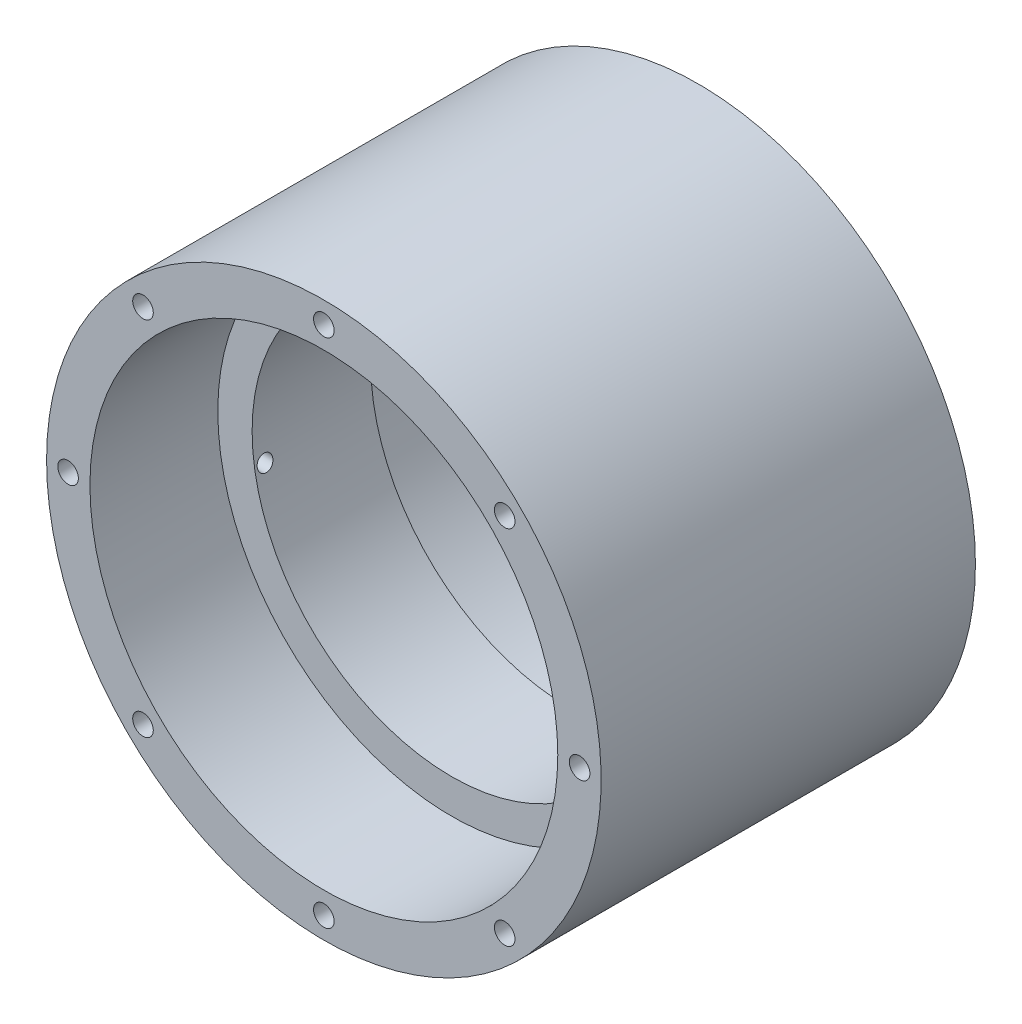
ISO-10303-21;
HEADER;
FILE_DESCRIPTION(('STEP AP214'),'2;1');
FILE_NAME('part.step','',(''),(''),'','','');
FILE_SCHEMA(('AUTOMOTIVE_DESIGN { 1 0 10303 214 1 1 1 1 }'));
ENDSEC;
DATA;
#1=APPLICATION_CONTEXT('core data for automotive mechanical design processes');
#2=APPLICATION_PROTOCOL_DEFINITION('international standard','automotive_design',2000,#1);
#3=PRODUCT_CONTEXT('',#1,'mechanical');
#4=PRODUCT('Part','Part','',(#3));
#5=PRODUCT_RELATED_PRODUCT_CATEGORY('part','',(#4));
#6=PRODUCT_DEFINITION_FORMATION('','',#4);
#7=PRODUCT_DEFINITION_CONTEXT('part definition',#1,'design');
#8=PRODUCT_DEFINITION('design','',#6,#7);
#9=PRODUCT_DEFINITION_SHAPE('','',#8);
#10=(LENGTH_UNIT() NAMED_UNIT(*) SI_UNIT(.MILLI.,.METRE.));
#11=(NAMED_UNIT(*) PLANE_ANGLE_UNIT() SI_UNIT($,.RADIAN.));
#12=(NAMED_UNIT(*) SI_UNIT($,.STERADIAN.) SOLID_ANGLE_UNIT());
#13=UNCERTAINTY_MEASURE_WITH_UNIT(LENGTH_MEASURE(1.E-05),#10,'distance_accuracy_value','');
#14=(GEOMETRIC_REPRESENTATION_CONTEXT(3) GLOBAL_UNCERTAINTY_ASSIGNED_CONTEXT((#13)) GLOBAL_UNIT_ASSIGNED_CONTEXT((#10,
#11,#12)) REPRESENTATION_CONTEXT('',''));
#15=CARTESIAN_POINT('',(0.,0.,0.));
#16=DIRECTION('',(0.,0.,1.));
#17=DIRECTION('',(1.,0.,0.));
#18=AXIS2_PLACEMENT_3D('',#15,#16,#17);
#19=CARTESIAN_POINT('',(0.,0.,60.));
#20=DIRECTION('',(0.,0.,-1.));
#21=DIRECTION('',(-1.,0.,0.));
#22=AXIS2_PLACEMENT_3D('',#19,#20,#21);
#23=CYLINDRICAL_SURFACE('',#22,44.45);
#24=DIRECTION('',(0.,0.,-1.));
#25=VECTOR('',#24,1.);
#26=CARTESIAN_POINT('',(-43.7241637998945,-7.99999999999999,50.));
#27=LINE('',#26,#25);
#28=CARTESIAN_POINT('',(-43.7241637998945,-7.99999999999999,50.));
#29=VERTEX_POINT('',#28);
#30=CARTESIAN_POINT('',(-43.7241637998945,-7.99999999999999,0.));
#31=VERTEX_POINT('',#30);
#32=EDGE_CURVE('E61',#29,#31,#27,.T.);
#33=ORIENTED_EDGE('',*,*,#32,.T.);
#34=CARTESIAN_POINT('',(0.,0.,0.));
#35=DIRECTION('',(0.,0.,-1.));
#36=DIRECTION('',(-1.,0.,0.));
#37=AXIS2_PLACEMENT_3D('',#34,#35,#36);
#38=CIRCLE('',#37,44.45);
#39=CARTESIAN_POINT('',(-43.7241637998945,7.99999999999994,0.));
#40=VERTEX_POINT('',#39);
#41=EDGE_CURVE('E48',#40,#31,#38,.T.);
#42=ORIENTED_EDGE('',*,*,#41,.F.);
#43=DIRECTION('',(0.,0.,-1.));
#44=VECTOR('',#43,1.);
#45=CARTESIAN_POINT('',(-43.7241637998945,7.99999999999998,50.));
#46=LINE('',#45,#44);
#47=CARTESIAN_POINT('',(-43.7241637998945,7.99999999999998,50.));
#48=VERTEX_POINT('',#47);
#49=EDGE_CURVE('E55',#48,#40,#46,.T.);
#50=ORIENTED_EDGE('',*,*,#49,.F.);
#51=CARTESIAN_POINT('',(0.,0.,50.));
#52=DIRECTION('',(0.,0.,-1.));
#53=DIRECTION('',(-1.,0.,0.));
#54=AXIS2_PLACEMENT_3D('',#51,#52,#53);
#55=CIRCLE('',#54,44.45);
#56=EDGE_CURVE('E72',#29,#48,#55,.T.);
#57=ORIENTED_EDGE('',*,*,#56,.F.);
#58=EDGE_LOOP('',(#33,#42,#50,#57));
#59=FACE_BOUND('',#58,.T.);
#60=CARTESIAN_POINT('',(0.,0.,60.));
#61=DIRECTION('',(0.,0.,-1.));
#62=DIRECTION('',(-1.,0.,0.));
#63=AXIS2_PLACEMENT_3D('',#60,#61,#62);
#64=CIRCLE('',#63,44.45);
#65=CARTESIAN_POINT('',(-44.45,0.,60.));
#66=VERTEX_POINT('',#65);
#67=EDGE_CURVE('E11',#66,#66,#64,.T.);
#68=ORIENTED_EDGE('',*,*,#67,.T.);
#69=EDGE_LOOP('',(#68));
#70=FACE_BOUND('',#69,.T.);
#71=ADVANCED_FACE('F40',(#59,#70),#23,.T.);
#72=CARTESIAN_POINT('',(44.45,0.,60.));
#73=DIRECTION('',(0.,0.,1.));
#74=DIRECTION('',(1.,0.,0.));
#75=AXIS2_PLACEMENT_3D('',#72,#73,#74);
#76=PLANE('',#75);
#77=CARTESIAN_POINT('',(28.9913780286488,28.9913780286481,60.));
#78=DIRECTION('',(0.,0.,1.));
#79=DIRECTION('',(1.,0.,0.));
#80=AXIS2_PLACEMENT_3D('',#77,#78,#79);
#81=CIRCLE('',#80,1.64999999999998);
#82=CARTESIAN_POINT('',(30.6413780286488,28.9913780286481,60.));
#83=VERTEX_POINT('',#82);
#84=EDGE_CURVE('E173',#83,#83,#81,.T.);
#85=ORIENTED_EDGE('',*,*,#84,.F.);
#86=EDGE_LOOP('',(#85));
#87=FACE_BOUND('',#86,.T.);
#88=CARTESIAN_POINT('',(4.29452204677705E-13,41.,60.));
#89=DIRECTION('',(0.,0.,1.));
#90=DIRECTION('',(1.,0.,0.));
#91=AXIS2_PLACEMENT_3D('',#88,#89,#90);
#92=CIRCLE('',#91,1.64999999999998);
#93=CARTESIAN_POINT('',(1.65000000000041,41.,60.));
#94=VERTEX_POINT('',#93);
#95=EDGE_CURVE('E166',#94,#94,#92,.T.);
#96=ORIENTED_EDGE('',*,*,#95,.F.);
#97=EDGE_LOOP('',(#96));
#98=FACE_BOUND('',#97,.T.);
#99=CARTESIAN_POINT('',(-28.9913780286482,28.9913780286487,60.));
#100=DIRECTION('',(0.,0.,1.));
#101=DIRECTION('',(1.,0.,0.));
#102=AXIS2_PLACEMENT_3D('',#99,#100,#101);
#103=CIRCLE('',#102,1.64999999999998);
#104=CARTESIAN_POINT('',(-27.3413780286482,28.9913780286487,60.));
#105=VERTEX_POINT('',#104);
#106=EDGE_CURVE('E158',#105,#105,#103,.T.);
#107=ORIENTED_EDGE('',*,*,#106,.F.);
#108=EDGE_LOOP('',(#107));
#109=FACE_BOUND('',#108,.T.);
#110=CARTESIAN_POINT('',(-41.,2.86301469785137E-13,60.));
#111=DIRECTION('',(0.,0.,1.));
#112=DIRECTION('',(1.,0.,0.));
#113=AXIS2_PLACEMENT_3D('',#110,#111,#112);
#114=CIRCLE('',#113,1.64999999999998);
#115=CARTESIAN_POINT('',(-39.35,2.86301469785137E-13,60.));
#116=VERTEX_POINT('',#115);
#117=EDGE_CURVE('E150',#116,#116,#114,.T.);
#118=ORIENTED_EDGE('',*,*,#117,.F.);
#119=EDGE_LOOP('',(#118));
#120=FACE_BOUND('',#119,.T.);
#121=CARTESIAN_POINT('',(-28.9913780286486,-28.9913780286483,60.));
#122=DIRECTION('',(0.,0.,1.));
#123=DIRECTION('',(1.,0.,0.));
#124=AXIS2_PLACEMENT_3D('',#121,#122,#123);
#125=CIRCLE('',#124,1.64999999999998);
#126=CARTESIAN_POINT('',(-27.3413780286486,-28.9913780286483,60.));
#127=VERTEX_POINT('',#126);
#128=EDGE_CURVE('E142',#127,#127,#125,.T.);
#129=ORIENTED_EDGE('',*,*,#128,.F.);
#130=EDGE_LOOP('',(#129));
#131=FACE_BOUND('',#130,.T.);
#132=CARTESIAN_POINT('',(-1.43150734892569E-13,-41.,60.));
#133=DIRECTION('',(0.,0.,1.));
#134=DIRECTION('',(1.,0.,0.));
#135=AXIS2_PLACEMENT_3D('',#132,#133,#134);
#136=CIRCLE('',#135,1.64999999999998);
#137=CARTESIAN_POINT('',(1.64999999999984,-41.,60.));
#138=VERTEX_POINT('',#137);
#139=EDGE_CURVE('E134',#138,#138,#136,.T.);
#140=ORIENTED_EDGE('',*,*,#139,.F.);
#141=EDGE_LOOP('',(#140));
#142=FACE_BOUND('',#141,.T.);
#143=CARTESIAN_POINT('',(28.9913780286484,-28.9913780286485,60.));
#144=DIRECTION('',(0.,0.,1.));
#145=DIRECTION('',(1.,0.,0.));
#146=AXIS2_PLACEMENT_3D('',#143,#144,#145);
#147=CIRCLE('',#146,1.64999999999998);
#148=CARTESIAN_POINT('',(30.6413780286484,-28.9913780286485,60.));
#149=VERTEX_POINT('',#148);
#150=EDGE_CURVE('E126',#149,#149,#147,.T.);
#151=ORIENTED_EDGE('',*,*,#150,.F.);
#152=EDGE_LOOP('',(#151));
#153=FACE_BOUND('',#152,.T.);
#154=CARTESIAN_POINT('',(41.,0.,60.));
#155=DIRECTION('',(0.,0.,1.));
#156=DIRECTION('',(1.,0.,0.));
#157=AXIS2_PLACEMENT_3D('',#154,#155,#156);
#158=CIRCLE('',#157,1.64999999999998);
#159=CARTESIAN_POINT('',(42.65,0.,60.));
#160=VERTEX_POINT('',#159);
#161=EDGE_CURVE('E118',#160,#160,#158,.T.);
#162=ORIENTED_EDGE('',*,*,#161,.F.);
#163=EDGE_LOOP('',(#162));
#164=FACE_BOUND('',#163,.T.);
#165=CARTESIAN_POINT('',(0.,0.,60.));
#166=DIRECTION('',(0.,0.,-1.));
#167=DIRECTION('',(-1.,0.,0.));
#168=AXIS2_PLACEMENT_3D('',#165,#166,#167);
#169=CIRCLE('',#168,37.5);
#170=CARTESIAN_POINT('',(-37.5,0.,60.));
#171=VERTEX_POINT('',#170);
#172=EDGE_CURVE('E73',#171,#171,#169,.T.);
#173=ORIENTED_EDGE('',*,*,#172,.T.);
#174=EDGE_LOOP('',(#173));
#175=FACE_BOUND('',#174,.T.);
#176=ORIENTED_EDGE('',*,*,#67,.F.);
#177=EDGE_LOOP('',(#176));
#178=FACE_BOUND('',#177,.T.);
#179=ADVANCED_FACE('F228',(#87,#98,#109,#120,#131,#142,#153,#164,#175,#178),#76,.T.);
#180=CARTESIAN_POINT('',(0.,0.,0.));
#181=DIRECTION('',(0.,0.,-1.));
#182=DIRECTION('',(-1.,0.,0.));
#183=AXIS2_PLACEMENT_3D('',#180,#181,#182);
#184=PLANE('',#183);
#185=CARTESIAN_POINT('',(0.,0.,0.));
#186=DIRECTION('',(0.,0.,-1.));
#187=DIRECTION('',(-1.,0.,0.));
#188=AXIS2_PLACEMENT_3D('',#185,#186,#187);
#189=CIRCLE('',#188,37.5);
#190=CARTESIAN_POINT('',(-37.5,0.,0.));
#191=VERTEX_POINT('',#190);
#192=EDGE_CURVE('E94',#191,#191,#189,.T.);
#193=ORIENTED_EDGE('',*,*,#192,.F.);
#194=EDGE_LOOP('',(#193));
#195=FACE_BOUND('',#194,.T.);
#196=DIRECTION('',(0.,-1.,0.));
#197=VECTOR('',#196,1.);
#198=CARTESIAN_POINT('',(-43.7241637998945,7.99999999999998,0.));
#199=LINE('',#198,#197);
#200=EDGE_CURVE('E66',#40,#31,#199,.T.);
#201=ORIENTED_EDGE('',*,*,#200,.F.);
#202=ORIENTED_EDGE('',*,*,#41,.T.);
#203=EDGE_LOOP('',(#201,#202));
#204=FACE_BOUND('',#203,.T.);
#205=ADVANCED_FACE('F80',(#195,#204),#184,.T.);
#206=CARTESIAN_POINT('',(-43.7241637998945,7.99999999999998,50.));
#207=DIRECTION('',(1.,0.,0.));
#208=DIRECTION('',(0.,1.,0.));
#209=AXIS2_PLACEMENT_3D('',#206,#207,#208);
#210=PLANE('',#209);
#211=CARTESIAN_POINT('',(-43.7241637998945,-5.05000000000007,37.8347480327554));
#212=DIRECTION('',(-1.,0.,0.));
#213=DIRECTION('',(0.,0.,1.));
#214=AXIS2_PLACEMENT_3D('',#211,#212,#213);
#215=CIRCLE('',#214,1.24999999999999);
#216=CARTESIAN_POINT('',(-43.7241637998945,-5.05000000000007,39.0847480327554));
#217=VERTEX_POINT('',#216);
#218=EDGE_CURVE('E207',#217,#217,#215,.T.);
#219=ORIENTED_EDGE('',*,*,#218,.F.);
#220=EDGE_LOOP('',(#219));
#221=FACE_BOUND('',#220,.T.);
#222=CARTESIAN_POINT('',(-43.7241637998945,5.14999999999991,15.5847480327554));
#223=DIRECTION('',(-1.,0.,0.));
#224=DIRECTION('',(0.,0.,1.));
#225=AXIS2_PLACEMENT_3D('',#222,#223,#224);
#226=CIRCLE('',#225,1.24999999999999);
#227=CARTESIAN_POINT('',(-43.7241637998945,5.14999999999991,16.8347480327554));
#228=VERTEX_POINT('',#227);
#229=EDGE_CURVE('E186',#228,#228,#226,.T.);
#230=ORIENTED_EDGE('',*,*,#229,.F.);
#231=EDGE_LOOP('',(#230));
#232=FACE_BOUND('',#231,.T.);
#233=ORIENTED_EDGE('',*,*,#200,.T.);
#234=ORIENTED_EDGE('',*,*,#32,.F.);
#235=DIRECTION('',(0.,-1.,0.));
#236=VECTOR('',#235,1.);
#237=CARTESIAN_POINT('',(-43.7241637998945,7.99999999999998,50.));
#238=LINE('',#237,#236);
#239=EDGE_CURVE('E85',#48,#29,#238,.T.);
#240=ORIENTED_EDGE('',*,*,#239,.F.);
#241=ORIENTED_EDGE('',*,*,#49,.T.);
#242=EDGE_LOOP('',(#233,#234,#240,#241));
#243=FACE_BOUND('',#242,.T.);
#244=ADVANCED_FACE('F67',(#221,#232,#243),#210,.F.);
#245=CARTESIAN_POINT('',(0.,0.,50.));
#246=DIRECTION('',(0.,0.,-1.));
#247=DIRECTION('',(-1.,0.,0.));
#248=AXIS2_PLACEMENT_3D('',#245,#246,#247);
#249=PLANE('',#248);
#250=ORIENTED_EDGE('',*,*,#56,.T.);
#251=ORIENTED_EDGE('',*,*,#239,.T.);
#252=EDGE_LOOP('',(#250,#251));
#253=FACE_BOUND('',#252,.T.);
#254=ADVANCED_FACE('F216',(#253),#249,.T.);
#255=CARTESIAN_POINT('',(0.,0.,60.));
#256=DIRECTION('',(0.,0.,-1.));
#257=DIRECTION('',(-1.,0.,0.));
#258=AXIS2_PLACEMENT_3D('',#255,#256,#257);
#259=CYLINDRICAL_SURFACE('',#258,37.5);
#260=ORIENTED_EDGE('',*,*,#172,.F.);
#261=EDGE_LOOP('',(#260));
#262=FACE_BOUND('',#261,.T.);
#263=CARTESIAN_POINT('',(0.,0.,39.5));
#264=DIRECTION('',(0.,0.,-1.));
#265=DIRECTION('',(-1.,0.,0.));
#266=AXIS2_PLACEMENT_3D('',#263,#264,#265);
#267=CIRCLE('',#266,37.5);
#268=CARTESIAN_POINT('',(-37.5,0.,39.5));
#269=VERTEX_POINT('',#268);
#270=EDGE_CURVE('E110',#269,#269,#267,.T.);
#271=ORIENTED_EDGE('',*,*,#270,.T.);
#272=EDGE_LOOP('',(#271));
#273=FACE_BOUND('',#272,.T.);
#274=ADVANCED_FACE('F225',(#262,#273),#259,.F.);
#275=CARTESIAN_POINT('',(0.,0.,60.));
#276=DIRECTION('',(0.,0.,-1.));
#277=DIRECTION('',(-1.,0.,0.));
#278=AXIS2_PLACEMENT_3D('',#275,#276,#277);
#279=CYLINDRICAL_SURFACE('',#278,37.5);
#280=CARTESIAN_POINT('',(-37.144683334227,5.14999999999991,16.8347480327554));
#281=CARTESIAN_POINT('',(-37.1348528911148,5.22090051073942,16.8347449450375));
#282=CARTESIAN_POINT('',(-37.1248106513063,5.29182459819324,16.8286963232049));
#283=CARTESIAN_POINT('',(-37.1046086195653,5.43166899050378,16.8046693009774));
#284=CARTESIAN_POINT('',(-37.0944486964647,5.50058668172742,16.7866760082665));
#285=CARTESIAN_POINT('',(-37.0743616385239,5.63438406331942,16.7392631093398));
#286=CARTESIAN_POINT('',(-37.0644344074721,5.69926544161951,16.7098483172179));
#287=CARTESIAN_POINT('',(-37.0451732269609,5.82314994177625,16.6404046422333));
#288=CARTESIAN_POINT('',(-37.0358391210029,5.88215461657673,16.6003785737378));
#289=CARTESIAN_POINT('',(-37.0181484620944,5.99247897915528,16.510902512055));
#290=CARTESIAN_POINT('',(-37.0097898163284,6.04381518822893,16.4614733158417));
#291=CARTESIAN_POINT('',(-36.994379464664,6.13743799182848,16.3544997378289));
#292=CARTESIAN_POINT('',(-36.9873277433184,6.17972469331536,16.2969554519593));
#293=CARTESIAN_POINT('',(-36.9749153479508,6.25356115348532,16.1760328728788));
#294=CARTESIAN_POINT('',(-36.9695374310235,6.28522067548756,16.1127233902448));
#295=CARTESIAN_POINT('',(-36.9606212604343,6.33744290485986,15.9815612417574));
#296=CARTESIAN_POINT('',(-36.9570828495687,6.35800656048572,15.9137089646897));
#297=CARTESIAN_POINT('',(-36.9520492466531,6.38719617492573,15.7763487578726));
#298=CARTESIAN_POINT('',(-36.9505277219078,6.39597600407855,15.7068744677431));
#299=CARTESIAN_POINT('',(-36.9495145861352,6.40182641977568,15.5674216524102));
#300=CARTESIAN_POINT('',(-36.9500228646396,6.39889764353856,15.4974431548543));
#301=CARTESIAN_POINT('',(-36.9530336945292,6.38148698474805,15.3594951754045));
#302=CARTESIAN_POINT('',(-36.9555219470029,6.36708793701472,15.2915148995373));
#303=CARTESIAN_POINT('',(-36.9623580246327,6.3272817010028,15.1589581923875));
#304=CARTESIAN_POINT('',(-36.9667058695097,6.30187439598112,15.0943817972114));
#305=CARTESIAN_POINT('',(-36.9770827601659,6.24069803024955,14.970184866816));
#306=CARTESIAN_POINT('',(-36.983118082518,6.20489026534491,14.9105839338025));
#307=CARTESIAN_POINT('',(-36.9965981456411,6.12400209385604,14.798228800226));
#308=CARTESIAN_POINT('',(-37.0040429693984,6.07892114128647,14.745475003106));
#309=CARTESIAN_POINT('',(-37.0201292159303,5.98018050394595,14.6476308799104));
#310=CARTESIAN_POINT('',(-37.0287839028091,5.92642453564731,14.6026399100731));
#311=CARTESIAN_POINT('',(-37.0468765562931,5.81225203153841,14.522300033647));
#312=CARTESIAN_POINT('',(-37.0563145776811,5.75183502978858,14.4869518021697));
#313=CARTESIAN_POINT('',(-37.0757453062318,5.62523391871104,14.4264584466028));
#314=CARTESIAN_POINT('',(-37.0857434329323,5.55898768513162,14.4014450215018));
#315=CARTESIAN_POINT('',(-37.105837369471,5.42324059699343,14.3629388696798));
#316=CARTESIAN_POINT('',(-37.1159331832372,5.35373961112239,14.3494466082008));
#317=CARTESIAN_POINT('',(-37.1359611780551,5.21300936433585,14.3343211631203));
#318=CARTESIAN_POINT('',(-37.1458920406966,5.14177232097843,14.3327584832582));
#319=CARTESIAN_POINT('',(-37.1652413669283,4.99999535897765,14.3417501007413));
#320=CARTESIAN_POINT('',(-37.1746598327812,4.9294554372568,14.3523043445714));
#321=CARTESIAN_POINT('',(-37.1927245810604,4.79125109340386,14.3852338469232));
#322=CARTESIAN_POINT('',(-37.2013725018675,4.72358073868491,14.4075832890255));
#323=CARTESIAN_POINT('',(-37.2177300857738,4.59291914330473,14.4634942945913));
#324=CARTESIAN_POINT('',(-37.2254397815039,4.52992773994223,14.4970554679657));
#325=CARTESIAN_POINT('',(-37.2397305630399,4.41090027827992,14.5741909051058));
#326=CARTESIAN_POINT('',(-37.2463192036033,4.35481842717962,14.617693101265));
#327=CARTESIAN_POINT('',(-37.2583397294966,4.25074937895236,14.713624643073));
#328=CARTESIAN_POINT('',(-37.2637716609072,4.20276185938029,14.7660536329475));
#329=CARTESIAN_POINT('',(-37.2733846739309,4.1166326816723,14.877925374925));
#330=CARTESIAN_POINT('',(-37.2775748230358,4.07841994392651,14.9373126302776));
#331=CARTESIAN_POINT('',(-37.2847278907407,4.0125017603857,15.0617249423557));
#332=CARTESIAN_POINT('',(-37.2876908482523,3.98479598144007,15.1267498202451));
#333=CARTESIAN_POINT('',(-37.2923630418455,3.94083091658892,15.260216685987));
#334=CARTESIAN_POINT('',(-37.294078885748,3.92451131982482,15.3286385808647));
#335=CARTESIAN_POINT('',(-37.2962777184731,3.90356006865423,15.4672682188042));
#336=CARTESIAN_POINT('',(-37.2967607269552,3.89892822786913,15.5374759333703));
#337=CARTESIAN_POINT('',(-37.2964933123858,3.90148533965298,15.6774920819659));
#338=CARTESIAN_POINT('',(-37.2957460548888,3.90864395463081,15.7473010783946));
#339=CARTESIAN_POINT('',(-37.2930256755793,3.93451432165206,15.8847193049675));
#340=CARTESIAN_POINT('',(-37.2910525577753,3.95322603591851,15.9523285423038));
#341=CARTESIAN_POINT('',(-37.285886575909,4.00165607824829,16.0834365931672));
#342=CARTESIAN_POINT('',(-37.282693640832,4.03137504712507,16.1469351671293));
#343=CARTESIAN_POINT('',(-37.2751046064624,4.10095060576332,16.2680278489174));
#344=CARTESIAN_POINT('',(-37.2707085462307,4.14080686640329,16.3256221483487));
#345=CARTESIAN_POINT('',(-37.2607349755815,4.22961286855187,16.433439906076));
#346=CARTESIAN_POINT('',(-37.2551544982269,4.27858540752631,16.4836443077821));
#347=CARTESIAN_POINT('',(-37.2428785516507,4.3841550189487,16.5751323321814));
#348=CARTESIAN_POINT('',(-37.2361827842689,4.44075412949945,16.6164135625664));
#349=CARTESIAN_POINT('',(-37.221733265501,4.56028678918127,16.6891315414998));
#350=CARTESIAN_POINT('',(-37.2139735623147,4.62325540998598,16.7205093741549));
#351=CARTESIAN_POINT('',(-37.197572847733,4.75340502453666,16.7722266841077));
#352=CARTESIAN_POINT('',(-37.1889328518474,4.82058113078725,16.792578713305));
#353=CARTESIAN_POINT('',(-37.1743078287966,4.93180720303172,16.8163415002608));
#354=CARTESIAN_POINT('',(-37.1685297672093,4.97517127671192,16.8232375260162));
#355=CARTESIAN_POINT('',(-37.1567558924915,5.0623538965539,16.8324417518367));
#356=CARTESIAN_POINT('',(-37.1507600788648,5.1061724437512,16.8347499414459));
#357=CARTESIAN_POINT('',(-37.144683334227,5.14999999999991,16.8347480327554));
#358=B_SPLINE_CURVE_WITH_KNOTS('',3,(#280,#281,#282,#283,#284,#285,#286,#287,#288,#289,#290,
#291,#292,#293,#294,#295,#296,#297,#298,#299,#300,#301,#302,#303,#304,#305,#306,#307,#308,#309,
#310,#311,#312,#313,#314,#315,#316,#317,#318,#319,#320,#321,#322,#323,#324,#325,#326,#327,#328,
#329,#330,#331,#332,#333,#334,#335,#336,#337,#338,#339,#340,#341,#342,#343,#344,#345,#346,#347,
#348,#349,#350,#351,#352,#353,#354,#355,#356,#357),.UNSPECIFIED.,.T.,.F.,(4,2,2,2,2,2,2,2,2,2,2,
2,2,2,2,2,2,2,2,2,2,2,2,2,2,2,2,2,2,2,2,2,2,2,2,2,2,2,4),(0.,0.214574812460327,
0.429417655127943,0.644170040946635,0.858865526122726,1.07309157499613,1.28731509167714,
1.49925252902309,1.71117185126716,1.92029614915831,2.12940906601248,2.33702537581528,
2.54464388745263,2.75304515124104,2.96145868876162,3.17236847438735,3.38329302253361,
3.59682818625758,3.81037197244642,4.02517683103878,4.23998074093472,4.45431644257557,
4.66864468762418,4.88146585846975,5.09427854938609,5.30549666204981,5.51670807693056,
5.72679206547084,5.9368727038889,6.1464136354944,6.35595388193475,6.56550632917573,
6.77505197386892,6.98512885488301,7.19526198798583,7.40662262819543,7.61774214472134,
7.7503824900707,7.88302313771301),.UNSPECIFIED.);
#359=CARTESIAN_POINT('',(-37.144683334227,5.14999999999991,16.8347480327554));
#360=VERTEX_POINT('',#359);
#361=EDGE_CURVE('E177',#360,#360,#358,.T.);
#362=ORIENTED_EDGE('',*,*,#361,.T.);
#363=EDGE_LOOP('',(#362));
#364=FACE_BOUND('',#363,.T.);
#365=CARTESIAN_POINT('',(0.,0.,20.5));
#366=DIRECTION('',(0.,0.,-1.));
#367=DIRECTION('',(-1.,0.,0.));
#368=AXIS2_PLACEMENT_3D('',#365,#366,#367);
#369=CIRCLE('',#368,37.5);
#370=CARTESIAN_POINT('',(-37.5,0.,20.5));
#371=VERTEX_POINT('',#370);
#372=EDGE_CURVE('E98',#371,#371,#369,.T.);
#373=ORIENTED_EDGE('',*,*,#372,.F.);
#374=EDGE_LOOP('',(#373));
#375=FACE_BOUND('',#374,.T.);
#376=ORIENTED_EDGE('',*,*,#192,.T.);
#377=EDGE_LOOP('',(#376));
#378=FACE_BOUND('',#377,.T.);
#379=ADVANCED_FACE('F260',(#364,#375,#378),#279,.F.);
#380=CARTESIAN_POINT('',(37.5,0.,20.5));
#381=DIRECTION('',(0.,0.,1.));
#382=DIRECTION('',(1.,0.,0.));
#383=AXIS2_PLACEMENT_3D('',#380,#381,#382);
#384=PLANE('',#383);
#385=CARTESIAN_POINT('',(0.,0.,20.5));
#386=DIRECTION('',(0.,0.,-1.));
#387=DIRECTION('',(-1.,0.,0.));
#388=AXIS2_PLACEMENT_3D('',#385,#386,#387);
#389=CIRCLE('',#388,32.);
#390=CARTESIAN_POINT('',(-32.,0.,20.5));
#391=VERTEX_POINT('',#390);
#392=EDGE_CURVE('E102',#391,#391,#389,.T.);
#393=ORIENTED_EDGE('',*,*,#392,.F.);
#394=EDGE_LOOP('',(#393));
#395=FACE_BOUND('',#394,.T.);
#396=ORIENTED_EDGE('',*,*,#372,.T.);
#397=EDGE_LOOP('',(#396));
#398=FACE_BOUND('',#397,.T.);
#399=ADVANCED_FACE('F274',(#395,#398),#384,.F.);
#400=CARTESIAN_POINT('',(0.,0.,60.));
#401=DIRECTION('',(0.,0.,-1.));
#402=DIRECTION('',(-1.,0.,0.));
#403=AXIS2_PLACEMENT_3D('',#400,#401,#402);
#404=CYLINDRICAL_SURFACE('',#403,32.);
#405=CARTESIAN_POINT('',(-31.5990110604746,-5.05000000000007,39.0847480327554));
#406=CARTESIAN_POINT('',(-31.6102891033159,-4.97942858720738,39.0847450608575));
#407=CARTESIAN_POINT('',(-31.6213366783599,-4.90877038482601,39.0787530651163));
#408=CARTESIAN_POINT('',(-31.6426713540702,-4.76931246784278,39.0548829999618));
#409=CARTESIAN_POINT('',(-31.6529575908903,-4.70051491890359,39.0369916520221));
#410=CARTESIAN_POINT('',(-31.6725244643878,-4.56681061042861,38.9897598570429));
#411=CARTESIAN_POINT('',(-31.6818051551345,-4.50190364177588,38.960420025992));
#412=CARTESIAN_POINT('',(-31.6991778737891,-4.37790436767826,38.8910777595899));
#413=CARTESIAN_POINT('',(-31.7072702117634,-4.31881054679376,38.8510781133037));
#414=CARTESIAN_POINT('',(-31.722087434473,-4.20859167579249,38.7618521571332));
#415=CARTESIAN_POINT('',(-31.728821994585,-4.15741089639364,38.7126963098968));
#416=CARTESIAN_POINT('',(-31.7409188447558,-4.06402436722578,38.6063434898743));
#417=CARTESIAN_POINT('',(-31.7462811485182,-4.02181852783235,38.5491465973963));
#418=CARTESIAN_POINT('',(-31.7555456181635,-3.94799936908926,38.4289076926337));
#419=CARTESIAN_POINT('',(-31.7594607788446,-3.91629205986199,38.3659243746026));
#420=CARTESIAN_POINT('',(-31.7658792481159,-3.86388624562626,38.235466162245));
#421=CARTESIAN_POINT('',(-31.7683826098751,-3.84318732603793,38.1679914371741));
#422=CARTESIAN_POINT('',(-31.7719593765968,-3.81350518594546,38.0308898226099));
#423=CARTESIAN_POINT('',(-31.7730410413861,-3.80445429874435,37.9612777909705));
#424=CARTESIAN_POINT('',(-31.7737995783917,-3.7981141654517,37.8215131287053));
#425=CARTESIAN_POINT('',(-31.7734764776757,-3.80082469273531,37.7513605085219));
#426=CARTESIAN_POINT('',(-31.7714283201624,-3.81790710734191,37.6126717390764));
#427=CARTESIAN_POINT('',(-31.7697064129067,-3.83225279691034,37.5441323139243));
#428=CARTESIAN_POINT('',(-31.7648685060241,-3.87214788568633,37.4104484346043));
#429=CARTESIAN_POINT('',(-31.7617525086584,-3.89769726672187,37.34530397493));
#430=CARTESIAN_POINT('',(-31.7541345343057,-3.95928008695441,37.2201769576665));
#431=CARTESIAN_POINT('',(-31.7496310724579,-3.99532475590018,37.1602000187676));
#432=CARTESIAN_POINT('',(-31.7392682252595,-4.0768289820651,37.0471607802378));
#433=CARTESIAN_POINT('',(-31.733408820624,-4.12228867318841,36.9940985789686));
#434=CARTESIAN_POINT('',(-31.7203600243388,-4.22152456574871,36.8961256809254));
#435=CARTESIAN_POINT('',(-31.7131647446278,-4.27533740571379,36.8512528875535));
#436=CARTESIAN_POINT('',(-31.6975551512946,-4.38956895748419,36.7711705720993));
#437=CARTESIAN_POINT('',(-31.6891407933419,-4.44998790949477,36.7359614015601));
#438=CARTESIAN_POINT('',(-31.6711594588842,-4.57621572932684,36.6758894999452));
#439=CARTESIAN_POINT('',(-31.6615837440788,-4.64206409235134,36.6511123929175));
#440=CARTESIAN_POINT('',(-31.6415287335983,-4.77685042253994,36.6129476285321));
#441=CARTESIAN_POINT('',(-31.6310493872883,-4.84578856273535,36.5995606098744));
#442=CARTESIAN_POINT('',(-31.609325115038,-4.98554060871946,36.5844140839569));
#443=CARTESIAN_POINT('',(-31.5980734734273,-5.05636647246416,36.5827745060373));
#444=CARTESIAN_POINT('',(-31.5752108488912,-5.19722548019936,36.5914441175516));
#445=CARTESIAN_POINT('',(-31.5635998453115,-5.26725857830859,36.6017539950256));
#446=CARTESIAN_POINT('',(-31.5402806677472,-5.4051481109854,36.6341539980978));
#447=CARTESIAN_POINT('',(-31.5285724713679,-5.47298221490968,36.6563392345689));
#448=CARTESIAN_POINT('',(-31.505556714952,-5.60395588744305,36.7119415119903));
#449=CARTESIAN_POINT('',(-31.4942491635228,-5.66709535522659,36.7453587940836));
#450=CARTESIAN_POINT('',(-31.4724600537168,-5.7868790795586,36.8225299746293));
#451=CARTESIAN_POINT('',(-31.4619785808262,-5.84352266416094,36.8662849410008));
#452=CARTESIAN_POINT('',(-31.4422734825977,-5.94863881470916,36.9629422502653));
#453=CARTESIAN_POINT('',(-31.433049793713,-5.9971117934869,37.0158441307232));
#454=CARTESIAN_POINT('',(-31.4163623768435,-6.08392251317164,37.1286917037353));
#455=CARTESIAN_POINT('',(-31.4088802354395,-6.12236686618559,37.1885526163383));
#456=CARTESIAN_POINT('',(-31.3958935952915,-6.18861944999391,37.3140931974283));
#457=CARTESIAN_POINT('',(-31.3903888793575,-6.21642884889723,37.3797722258956));
#458=CARTESIAN_POINT('',(-31.3817042582696,-6.26012208309218,37.5138325814496));
#459=CARTESIAN_POINT('',(-31.3784847912082,-6.27620899388857,37.5821451768007));
#460=CARTESIAN_POINT('',(-31.3743716959006,-6.29673826280625,37.7205650304702));
#461=CARTESIAN_POINT('',(-31.3734778592658,-6.30118166424754,37.7906721274232));
#462=CARTESIAN_POINT('',(-31.3740562876324,-6.29830080588364,37.9296985415372));
#463=CARTESIAN_POINT('',(-31.3754972964885,-6.29113199695902,37.9986212707544));
#464=CARTESIAN_POINT('',(-31.3806162831636,-6.26554783436723,38.1342582281655));
#465=CARTESIAN_POINT('',(-31.3842942360331,-6.24713260613572,38.2009724809826));
#466=CARTESIAN_POINT('',(-31.3937139314897,-6.19962160994403,38.3303499302796));
#467=CARTESIAN_POINT('',(-31.3994564146972,-6.17052200904079,38.3930116634468));
#468=CARTESIAN_POINT('',(-31.4127425869514,-6.10252392848839,38.5125553358801));
#469=CARTESIAN_POINT('',(-31.4202863180386,-6.06362522013086,38.5694371402008));
#470=CARTESIAN_POINT('',(-31.4369607266685,-5.97657802420914,38.6766413739151));
#471=CARTESIAN_POINT('',(-31.4461113125776,-5.92831258708006,38.7268657066191));
#472=CARTESIAN_POINT('',(-31.465552072119,-5.82424501402477,38.8185443696361));
#473=CARTESIAN_POINT('',(-31.4758426247834,-5.76844036999579,38.8599957695885));
#474=CARTESIAN_POINT('',(-31.4973575872857,-5.64979312328791,38.9337088700856));
#475=CARTESIAN_POINT('',(-31.5085954842139,-5.58684181270976,38.9657915019498));
#476=CARTESIAN_POINT('',(-31.5314201033916,-5.45654692219903,39.0188757689499));
#477=CARTESIAN_POINT('',(-31.5430064337641,-5.38920818407186,39.039889394269));
#478=CARTESIAN_POINT('',(-31.5620549458802,-5.27624155277635,39.0649456578556));
#479=CARTESIAN_POINT('',(-31.5695300613221,-5.23133520131989,39.0723601082684));
#480=CARTESIAN_POINT('',(-31.5843724065202,-5.14096459584863,39.082262276057));
#481=CARTESIAN_POINT('',(-31.5917396352997,-5.09550033679039,39.0847499488621));
#482=CARTESIAN_POINT('',(-31.5990110604746,-5.05000000000007,39.0847480327554));
#483=B_SPLINE_CURVE_WITH_KNOTS('',3,(#405,#406,#407,#408,#409,#410,#411,#412,#413,#414,#415,
#416,#417,#418,#419,#420,#421,#422,#423,#424,#425,#426,#427,#428,#429,#430,#431,#432,#433,#434,
#435,#436,#437,#438,#439,#440,#441,#442,#443,#444,#445,#446,#447,#448,#449,#450,#451,#452,#453,
#454,#455,#456,#457,#458,#459,#460,#461,#462,#463,#464,#465,#466,#467,#468,#469,#470,#471,#472,
#473,#474,#475,#476,#477,#478,#479,#480,#481,#482),.UNSPECIFIED.,.T.,.F.,(4,2,2,2,2,2,2,2,2,2,2,
2,2,2,2,2,2,2,2,2,2,2,2,2,2,2,2,2,2,2,2,2,2,2,2,2,2,2,4),(0.,0.214234628204967,
0.428708723549192,0.643171280651084,0.857577780143764,1.0703977816709,1.28321565786225,
1.49407320299883,1.70492280660286,1.91454191287912,2.124156980127,2.33330138361533,
2.54244544787962,2.75181411965184,2.96118576935257,3.17150316081169,3.38182820217962,
3.59384739249409,3.80587847101542,4.02007112515877,4.23427611295918,4.45022293605879,
4.66617439565587,4.8821481735586,5.0981110357957,5.31167472382463,5.52521494796715,
5.73496173973722,5.94468973644323,6.15163326600327,6.35857448748431,6.56559002031548,
6.77261038527797,6.98240449965126,7.19226857985572,7.40591461079638,7.61932873742055,
7.7574534988043,7.89557950974457),.UNSPECIFIED.);
#484=CARTESIAN_POINT('',(-31.5990110604746,-5.05000000000007,39.0847480327554));
#485=VERTEX_POINT('',#484);
#486=EDGE_CURVE('E200',#485,#485,#483,.T.);
#487=ORIENTED_EDGE('',*,*,#486,.T.);
#488=EDGE_LOOP('',(#487));
#489=FACE_BOUND('',#488,.T.);
#490=CARTESIAN_POINT('',(0.,0.,39.5));
#491=DIRECTION('',(0.,0.,-1.));
#492=DIRECTION('',(-1.,0.,0.));
#493=AXIS2_PLACEMENT_3D('',#490,#491,#492);
#494=CIRCLE('',#493,32.);
#495=CARTESIAN_POINT('',(-32.,0.,39.5));
#496=VERTEX_POINT('',#495);
#497=EDGE_CURVE('E106',#496,#496,#494,.T.);
#498=ORIENTED_EDGE('',*,*,#497,.F.);
#499=EDGE_LOOP('',(#498));
#500=FACE_BOUND('',#499,.T.);
#501=ORIENTED_EDGE('',*,*,#392,.T.);
#502=EDGE_LOOP('',(#501));
#503=FACE_BOUND('',#502,.T.);
#504=ADVANCED_FACE('F268',(#489,#500,#503),#404,.F.);
#505=CARTESIAN_POINT('',(32.,0.,39.5));
#506=DIRECTION('',(0.,0.,-1.));
#507=DIRECTION('',(-1.,0.,0.));
#508=AXIS2_PLACEMENT_3D('',#505,#506,#507);
#509=PLANE('',#508);
#510=ORIENTED_EDGE('',*,*,#270,.F.);
#511=EDGE_LOOP('',(#510));
#512=FACE_BOUND('',#511,.T.);
#513=ORIENTED_EDGE('',*,*,#497,.T.);
#514=EDGE_LOOP('',(#513));
#515=FACE_BOUND('',#514,.T.);
#516=ADVANCED_FACE('F264',(#512,#515),#509,.F.);
#517=CARTESIAN_POINT('',(41.,0.,52.));
#518=DIRECTION('',(0.,0.,-1.));
#519=DIRECTION('',(-1.,0.,0.));
#520=AXIS2_PLACEMENT_3D('',#517,#518,#519);
#521=PLANE('',#520);
#522=CARTESIAN_POINT('',(41.,0.,52.));
#523=DIRECTION('',(0.,0.,1.));
#524=DIRECTION('',(1.,0.,0.));
#525=AXIS2_PLACEMENT_3D('',#522,#523,#524);
#526=CIRCLE('',#525,1.64999999999998);
#527=CARTESIAN_POINT('',(42.65,0.,52.));
#528=VERTEX_POINT('',#527);
#529=EDGE_CURVE('E114',#528,#528,#526,.T.);
#530=ORIENTED_EDGE('',*,*,#529,.T.);
#531=EDGE_LOOP('',(#530));
#532=FACE_BOUND('',#531,.T.);
#533=ADVANCED_FACE('F267',(#532),#521,.F.);
#534=CARTESIAN_POINT('',(41.,0.,60.));
#535=DIRECTION('',(0.,0.,1.));
#536=DIRECTION('',(1.,0.,0.));
#537=AXIS2_PLACEMENT_3D('',#534,#535,#536);
#538=CYLINDRICAL_SURFACE('',#537,1.64999999999998);
#539=ORIENTED_EDGE('',*,*,#529,.F.);
#540=EDGE_LOOP('',(#539));
#541=FACE_BOUND('',#540,.T.);
#542=ORIENTED_EDGE('',*,*,#161,.T.);
#543=EDGE_LOOP('',(#542));
#544=FACE_BOUND('',#543,.T.);
#545=ADVANCED_FACE('F294',(#541,#544),#538,.F.);
#546=CARTESIAN_POINT('',(28.9913780286484,-28.9913780286485,52.));
#547=DIRECTION('',(0.,0.,-1.));
#548=DIRECTION('',(-1.,0.,0.));
#549=AXIS2_PLACEMENT_3D('',#546,#547,#548);
#550=PLANE('',#549);
#551=CARTESIAN_POINT('',(28.9913780286484,-28.9913780286485,52.));
#552=DIRECTION('',(0.,0.,1.));
#553=DIRECTION('',(1.,0.,0.));
#554=AXIS2_PLACEMENT_3D('',#551,#552,#553);
#555=CIRCLE('',#554,1.64999999999998);
#556=CARTESIAN_POINT('',(30.6413780286484,-28.9913780286485,52.));
#557=VERTEX_POINT('',#556);
#558=EDGE_CURVE('E122',#557,#557,#555,.T.);
#559=ORIENTED_EDGE('',*,*,#558,.T.);
#560=EDGE_LOOP('',(#559));
#561=FACE_BOUND('',#560,.T.);
#562=ADVANCED_FACE('F298',(#561),#550,.F.);
#563=CARTESIAN_POINT('',(28.9913780286484,-28.9913780286485,60.));
#564=DIRECTION('',(0.,0.,1.));
#565=DIRECTION('',(1.,0.,0.));
#566=AXIS2_PLACEMENT_3D('',#563,#564,#565);
#567=CYLINDRICAL_SURFACE('',#566,1.64999999999998);
#568=ORIENTED_EDGE('',*,*,#558,.F.);
#569=EDGE_LOOP('',(#568));
#570=FACE_BOUND('',#569,.T.);
#571=ORIENTED_EDGE('',*,*,#150,.T.);
#572=EDGE_LOOP('',(#571));
#573=FACE_BOUND('',#572,.T.);
#574=ADVANCED_FACE('F302',(#570,#573),#567,.F.);
#575=CARTESIAN_POINT('',(-1.45110169771204E-13,-41.,52.));
#576=DIRECTION('',(0.,0.,-1.));
#577=DIRECTION('',(-1.,0.,0.));
#578=AXIS2_PLACEMENT_3D('',#575,#576,#577);
#579=PLANE('',#578);
#580=CARTESIAN_POINT('',(-1.43150734892569E-13,-41.,52.));
#581=DIRECTION('',(0.,0.,1.));
#582=DIRECTION('',(1.,0.,0.));
#583=AXIS2_PLACEMENT_3D('',#580,#581,#582);
#584=CIRCLE('',#583,1.64999999999998);
#585=CARTESIAN_POINT('',(1.64999999999984,-41.,52.));
#586=VERTEX_POINT('',#585);
#587=EDGE_CURVE('E130',#586,#586,#584,.T.);
#588=ORIENTED_EDGE('',*,*,#587,.T.);
#589=EDGE_LOOP('',(#588));
#590=FACE_BOUND('',#589,.T.);
#591=ADVANCED_FACE('F306',(#590),#579,.F.);
#592=CARTESIAN_POINT('',(-1.43150734892569E-13,-41.,60.));
#593=DIRECTION('',(0.,0.,1.));
#594=DIRECTION('',(1.,0.,0.));
#595=AXIS2_PLACEMENT_3D('',#592,#593,#594);
#596=CYLINDRICAL_SURFACE('',#595,1.64999999999998);
#597=ORIENTED_EDGE('',*,*,#587,.F.);
#598=EDGE_LOOP('',(#597));
#599=FACE_BOUND('',#598,.T.);
#600=ORIENTED_EDGE('',*,*,#139,.T.);
#601=EDGE_LOOP('',(#600));
#602=FACE_BOUND('',#601,.T.);
#603=ADVANCED_FACE('F310',(#599,#602),#596,.F.);
#604=CARTESIAN_POINT('',(-28.9913780286486,-28.9913780286483,52.));
#605=DIRECTION('',(0.,0.,-1.));
#606=DIRECTION('',(-1.,0.,0.));
#607=AXIS2_PLACEMENT_3D('',#604,#605,#606);
#608=PLANE('',#607);
#609=CARTESIAN_POINT('',(-28.9913780286486,-28.9913780286483,52.));
#610=DIRECTION('',(0.,0.,1.));
#611=DIRECTION('',(1.,0.,0.));
#612=AXIS2_PLACEMENT_3D('',#609,#610,#611);
#613=CIRCLE('',#612,1.64999999999998);
#614=CARTESIAN_POINT('',(-27.3413780286486,-28.9913780286483,52.));
#615=VERTEX_POINT('',#614);
#616=EDGE_CURVE('E138',#615,#615,#613,.T.);
#617=ORIENTED_EDGE('',*,*,#616,.T.);
#618=EDGE_LOOP('',(#617));
#619=FACE_BOUND('',#618,.T.);
#620=ADVANCED_FACE('F314',(#619),#608,.F.);
#621=CARTESIAN_POINT('',(-28.9913780286486,-28.9913780286483,60.));
#622=DIRECTION('',(0.,0.,1.));
#623=DIRECTION('',(1.,0.,0.));
#624=AXIS2_PLACEMENT_3D('',#621,#622,#623);
#625=CYLINDRICAL_SURFACE('',#624,1.64999999999998);
#626=ORIENTED_EDGE('',*,*,#616,.F.);
#627=EDGE_LOOP('',(#626));
#628=FACE_BOUND('',#627,.T.);
#629=ORIENTED_EDGE('',*,*,#128,.T.);
#630=EDGE_LOOP('',(#629));
#631=FACE_BOUND('',#630,.T.);
#632=ADVANCED_FACE('F318',(#628,#631),#625,.F.);
#633=CARTESIAN_POINT('',(-41.,2.86301469785137E-13,52.));
#634=DIRECTION('',(0.,0.,-1.));
#635=DIRECTION('',(-1.,0.,0.));
#636=AXIS2_PLACEMENT_3D('',#633,#634,#635);
#637=PLANE('',#636);
#638=CARTESIAN_POINT('',(-41.,2.86301469785137E-13,52.));
#639=DIRECTION('',(0.,0.,1.));
#640=DIRECTION('',(1.,0.,0.));
#641=AXIS2_PLACEMENT_3D('',#638,#639,#640);
#642=CIRCLE('',#641,1.64999999999998);
#643=CARTESIAN_POINT('',(-39.35,2.86301469785137E-13,52.));
#644=VERTEX_POINT('',#643);
#645=EDGE_CURVE('E146',#644,#644,#642,.T.);
#646=ORIENTED_EDGE('',*,*,#645,.T.);
#647=EDGE_LOOP('',(#646));
#648=FACE_BOUND('',#647,.T.);
#649=ADVANCED_FACE('F322',(#648),#637,.F.);
#650=CARTESIAN_POINT('',(-41.,2.86301469785137E-13,60.));
#651=DIRECTION('',(0.,0.,1.));
#652=DIRECTION('',(1.,0.,0.));
#653=AXIS2_PLACEMENT_3D('',#650,#651,#652);
#654=CYLINDRICAL_SURFACE('',#653,1.64999999999998);
#655=ORIENTED_EDGE('',*,*,#645,.F.);
#656=EDGE_LOOP('',(#655));
#657=FACE_BOUND('',#656,.T.);
#658=ORIENTED_EDGE('',*,*,#117,.T.);
#659=EDGE_LOOP('',(#658));
#660=FACE_BOUND('',#659,.T.);
#661=ADVANCED_FACE('F326',(#657,#660),#654,.F.);
#662=CARTESIAN_POINT('',(-28.9913780286482,28.9913780286487,52.));
#663=DIRECTION('',(0.,0.,-1.));
#664=DIRECTION('',(-1.,0.,0.));
#665=AXIS2_PLACEMENT_3D('',#662,#663,#664);
#666=PLANE('',#665);
#667=CARTESIAN_POINT('',(-28.9913780286482,28.9913780286487,52.));
#668=DIRECTION('',(0.,0.,1.));
#669=DIRECTION('',(1.,0.,0.));
#670=AXIS2_PLACEMENT_3D('',#667,#668,#669);
#671=CIRCLE('',#670,1.64999999999998);
#672=CARTESIAN_POINT('',(-27.3413780286482,28.9913780286487,52.));
#673=VERTEX_POINT('',#672);
#674=EDGE_CURVE('E154',#673,#673,#671,.T.);
#675=ORIENTED_EDGE('',*,*,#674,.T.);
#676=EDGE_LOOP('',(#675));
#677=FACE_BOUND('',#676,.T.);
#678=ADVANCED_FACE('F330',(#677),#666,.F.);
#679=CARTESIAN_POINT('',(-28.9913780286482,28.9913780286487,60.));
#680=DIRECTION('',(0.,0.,1.));
#681=DIRECTION('',(1.,0.,0.));
#682=AXIS2_PLACEMENT_3D('',#679,#680,#681);
#683=CYLINDRICAL_SURFACE('',#682,1.64999999999998);
#684=ORIENTED_EDGE('',*,*,#674,.F.);
#685=EDGE_LOOP('',(#684));
#686=FACE_BOUND('',#685,.T.);
#687=ORIENTED_EDGE('',*,*,#106,.T.);
#688=EDGE_LOOP('',(#687));
#689=FACE_BOUND('',#688,.T.);
#690=ADVANCED_FACE('F334',(#686,#689),#683,.F.);
#691=CARTESIAN_POINT('',(4.2749276979907E-13,41.,52.));
#692=DIRECTION('',(0.,0.,-1.));
#693=DIRECTION('',(-1.,0.,0.));
#694=AXIS2_PLACEMENT_3D('',#691,#692,#693);
#695=PLANE('',#694);
#696=CARTESIAN_POINT('',(4.29452204677705E-13,41.,52.));
#697=DIRECTION('',(0.,0.,1.));
#698=DIRECTION('',(1.,0.,0.));
#699=AXIS2_PLACEMENT_3D('',#696,#697,#698);
#700=CIRCLE('',#699,1.64999999999998);
#701=CARTESIAN_POINT('',(1.65000000000041,41.,52.));
#702=VERTEX_POINT('',#701);
#703=EDGE_CURVE('E162',#702,#702,#700,.T.);
#704=ORIENTED_EDGE('',*,*,#703,.T.);
#705=EDGE_LOOP('',(#704));
#706=FACE_BOUND('',#705,.T.);
#707=ADVANCED_FACE('F338',(#706),#695,.F.);
#708=CARTESIAN_POINT('',(4.29452204677705E-13,41.,60.));
#709=DIRECTION('',(0.,0.,1.));
#710=DIRECTION('',(1.,0.,0.));
#711=AXIS2_PLACEMENT_3D('',#708,#709,#710);
#712=CYLINDRICAL_SURFACE('',#711,1.64999999999998);
#713=ORIENTED_EDGE('',*,*,#703,.F.);
#714=EDGE_LOOP('',(#713));
#715=FACE_BOUND('',#714,.T.);
#716=ORIENTED_EDGE('',*,*,#95,.T.);
#717=EDGE_LOOP('',(#716));
#718=FACE_BOUND('',#717,.T.);
#719=ADVANCED_FACE('F342',(#715,#718),#712,.F.);
#720=CARTESIAN_POINT('',(28.9913780286488,28.9913780286481,52.));
#721=DIRECTION('',(0.,0.,-1.));
#722=DIRECTION('',(-1.,0.,0.));
#723=AXIS2_PLACEMENT_3D('',#720,#721,#722);
#724=PLANE('',#723);
#725=CARTESIAN_POINT('',(28.9913780286488,28.9913780286481,52.));
#726=DIRECTION('',(0.,0.,1.));
#727=DIRECTION('',(1.,0.,0.));
#728=AXIS2_PLACEMENT_3D('',#725,#726,#727);
#729=CIRCLE('',#728,1.64999999999998);
#730=CARTESIAN_POINT('',(30.6413780286488,28.9913780286481,52.));
#731=VERTEX_POINT('',#730);
#732=EDGE_CURVE('E170',#731,#731,#729,.T.);
#733=ORIENTED_EDGE('',*,*,#732,.T.);
#734=EDGE_LOOP('',(#733));
#735=FACE_BOUND('',#734,.T.);
#736=ADVANCED_FACE('F346',(#735),#724,.F.);
#737=CARTESIAN_POINT('',(28.9913780286488,28.9913780286481,60.));
#738=DIRECTION('',(0.,0.,1.));
#739=DIRECTION('',(1.,0.,0.));
#740=AXIS2_PLACEMENT_3D('',#737,#738,#739);
#741=CYLINDRICAL_SURFACE('',#740,1.64999999999998);
#742=ORIENTED_EDGE('',*,*,#732,.F.);
#743=EDGE_LOOP('',(#742));
#744=FACE_BOUND('',#743,.T.);
#745=ORIENTED_EDGE('',*,*,#84,.T.);
#746=EDGE_LOOP('',(#745));
#747=FACE_BOUND('',#746,.T.);
#748=ADVANCED_FACE('F195',(#744,#747),#741,.F.);
#749=CARTESIAN_POINT('',(-43.7241637998945,5.14999999999991,15.5847480327554));
#750=DIRECTION('',(-1.,0.,0.));
#751=DIRECTION('',(0.,0.,1.));
#752=AXIS2_PLACEMENT_3D('',#749,#750,#751);
#753=CYLINDRICAL_SURFACE('',#752,1.24999999999999);
#754=ORIENTED_EDGE('',*,*,#361,.F.);
#755=EDGE_LOOP('',(#754));
#756=FACE_BOUND('',#755,.T.);
#757=ORIENTED_EDGE('',*,*,#229,.T.);
#758=EDGE_LOOP('',(#757));
#759=FACE_BOUND('',#758,.T.);
#760=ADVANCED_FACE('F190',(#756,#759),#753,.F.);
#761=CARTESIAN_POINT('',(-43.7241637998945,-5.05000000000007,37.8347480327554));
#762=DIRECTION('',(-1.,0.,0.));
#763=DIRECTION('',(0.,0.,1.));
#764=AXIS2_PLACEMENT_3D('',#761,#762,#763);
#765=CYLINDRICAL_SURFACE('',#764,1.24999999999999);
#766=ORIENTED_EDGE('',*,*,#486,.F.);
#767=EDGE_LOOP('',(#766));
#768=FACE_BOUND('',#767,.T.);
#769=ORIENTED_EDGE('',*,*,#218,.T.);
#770=EDGE_LOOP('',(#769));
#771=FACE_BOUND('',#770,.T.);
#772=ADVANCED_FACE('F194',(#768,#771),#765,.F.);
#773=CLOSED_SHELL('',(#71,#179,#205,#244,#254,#274,#379,#399,#504,#516,#533,#545,#562,#574,#591,
#603,#620,#632,#649,#661,#678,#690,#707,#719,#736,#748,#760,#772));
#774=MANIFOLD_SOLID_BREP('B2',#773);
#775=ADVANCED_BREP_SHAPE_REPRESENTATION('',(#18,#774),#14);
#776=SHAPE_DEFINITION_REPRESENTATION(#9,#775);
ENDSEC;
END-ISO-10303-21;
